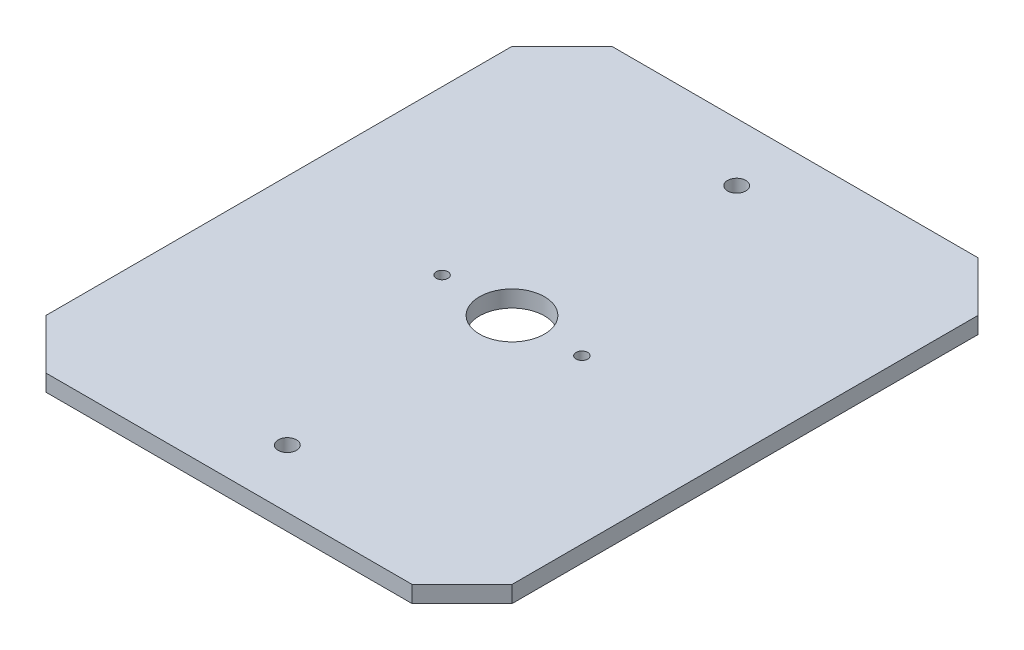
ISO-10303-21;
HEADER;
FILE_DESCRIPTION(('STEP AP214'),'2;1');
FILE_NAME('part.step','',(''),(''),'','','');
FILE_SCHEMA(('AUTOMOTIVE_DESIGN { 1 0 10303 214 1 1 1 1 }'));
ENDSEC;
DATA;
#1=APPLICATION_CONTEXT('core data for automotive mechanical design processes');
#2=APPLICATION_PROTOCOL_DEFINITION('international standard','automotive_design',2000,#1);
#3=PRODUCT_CONTEXT('',#1,'mechanical');
#4=PRODUCT('Part','Part','',(#3));
#5=PRODUCT_RELATED_PRODUCT_CATEGORY('part','',(#4));
#6=PRODUCT_DEFINITION_FORMATION('','',#4);
#7=PRODUCT_DEFINITION_CONTEXT('part definition',#1,'design');
#8=PRODUCT_DEFINITION('design','',#6,#7);
#9=PRODUCT_DEFINITION_SHAPE('','',#8);
#10=(LENGTH_UNIT() NAMED_UNIT(*) SI_UNIT(.MILLI.,.METRE.));
#11=(NAMED_UNIT(*) PLANE_ANGLE_UNIT() SI_UNIT($,.RADIAN.));
#12=(NAMED_UNIT(*) SI_UNIT($,.STERADIAN.) SOLID_ANGLE_UNIT());
#13=UNCERTAINTY_MEASURE_WITH_UNIT(LENGTH_MEASURE(1.E-05),#10,'distance_accuracy_value','');
#14=(GEOMETRIC_REPRESENTATION_CONTEXT(3) GLOBAL_UNCERTAINTY_ASSIGNED_CONTEXT((#13)) GLOBAL_UNIT_ASSIGNED_CONTEXT((#10,
#11,#12)) REPRESENTATION_CONTEXT('',''));
#15=CARTESIAN_POINT('',(0.,0.,0.));
#16=DIRECTION('',(0.,0.,1.));
#17=DIRECTION('',(1.,0.,0.));
#18=AXIS2_PLACEMENT_3D('',#15,#16,#17);
#19=CARTESIAN_POINT('',(-70.,5.,-85.));
#20=DIRECTION('',(1.,0.,0.));
#21=DIRECTION('',(0.,0.,-1.));
#22=AXIS2_PLACEMENT_3D('',#19,#20,#21);
#23=PLANE('',#22);
#24=DIRECTION('',(0.,0.,1.));
#25=VECTOR('',#24,1.);
#26=CARTESIAN_POINT('',(-70.,0.,-85.));
#27=LINE('',#26,#25);
#28=CARTESIAN_POINT('',(-70.,0.,-70.));
#29=VERTEX_POINT('',#28);
#30=CARTESIAN_POINT('',(-70.,0.,70.));
#31=VERTEX_POINT('',#30);
#32=EDGE_CURVE('E181',#29,#31,#27,.T.);
#33=ORIENTED_EDGE('',*,*,#32,.T.);
#34=DIRECTION('',(0.,1.,0.));
#35=VECTOR('',#34,1.);
#36=CARTESIAN_POINT('',(-70.,5.,70.));
#37=LINE('',#36,#35);
#38=CARTESIAN_POINT('',(-70.,5.,70.));
#39=VERTEX_POINT('',#38);
#40=EDGE_CURVE('E11',#31,#39,#37,.T.);
#41=ORIENTED_EDGE('',*,*,#40,.T.);
#42=DIRECTION('',(0.,0.,1.));
#43=VECTOR('',#42,1.);
#44=CARTESIAN_POINT('',(-70.,5.,-85.));
#45=LINE('',#44,#43);
#46=CARTESIAN_POINT('',(-70.,5.,-70.));
#47=VERTEX_POINT('',#46);
#48=EDGE_CURVE('E130',#47,#39,#45,.T.);
#49=ORIENTED_EDGE('',*,*,#48,.F.);
#50=DIRECTION('',(0.,-1.,0.));
#51=VECTOR('',#50,1.);
#52=CARTESIAN_POINT('',(-70.,5.,-70.));
#53=LINE('',#52,#51);
#54=EDGE_CURVE('E45',#47,#29,#53,.T.);
#55=ORIENTED_EDGE('',*,*,#54,.T.);
#56=EDGE_LOOP('',(#33,#41,#49,#55));
#57=FACE_BOUND('',#56,.T.);
#58=ADVANCED_FACE('F35',(#57),#23,.F.);
#59=CARTESIAN_POINT('',(70.,5.,85.));
#60=DIRECTION('',(0.,0.,-1.));
#61=DIRECTION('',(-1.,0.,0.));
#62=AXIS2_PLACEMENT_3D('',#59,#60,#61);
#63=PLANE('',#62);
#64=DIRECTION('',(1.,0.,0.));
#65=VECTOR('',#64,1.);
#66=CARTESIAN_POINT('',(70.,0.,85.));
#67=LINE('',#66,#65);
#68=CARTESIAN_POINT('',(-55.,0.,85.));
#69=VERTEX_POINT('',#68);
#70=CARTESIAN_POINT('',(55.,0.,85.));
#71=VERTEX_POINT('',#70);
#72=EDGE_CURVE('E135',#69,#71,#67,.T.);
#73=ORIENTED_EDGE('',*,*,#72,.T.);
#74=DIRECTION('',(0.,1.,0.));
#75=VECTOR('',#74,1.);
#76=CARTESIAN_POINT('',(55.,5.,85.));
#77=LINE('',#76,#75);
#78=CARTESIAN_POINT('',(55.,5.,85.));
#79=VERTEX_POINT('',#78);
#80=EDGE_CURVE('E53',#71,#79,#77,.T.);
#81=ORIENTED_EDGE('',*,*,#80,.T.);
#82=DIRECTION('',(1.,0.,0.));
#83=VECTOR('',#82,1.);
#84=CARTESIAN_POINT('',(70.,5.,85.));
#85=LINE('',#84,#83);
#86=CARTESIAN_POINT('',(-55.,5.,85.));
#87=VERTEX_POINT('',#86);
#88=EDGE_CURVE('E133',#87,#79,#85,.T.);
#89=ORIENTED_EDGE('',*,*,#88,.F.);
#90=DIRECTION('',(0.,-1.,0.));
#91=VECTOR('',#90,1.);
#92=CARTESIAN_POINT('',(-55.,5.,85.));
#93=LINE('',#92,#91);
#94=EDGE_CURVE('E154',#87,#69,#93,.T.);
#95=ORIENTED_EDGE('',*,*,#94,.T.);
#96=EDGE_LOOP('',(#73,#81,#89,#95));
#97=FACE_BOUND('',#96,.T.);
#98=ADVANCED_FACE('F191',(#97),#63,.F.);
#99=CARTESIAN_POINT('',(70.,5.,-85.));
#100=DIRECTION('',(-1.,0.,0.));
#101=DIRECTION('',(0.,0.,1.));
#102=AXIS2_PLACEMENT_3D('',#99,#100,#101);
#103=PLANE('',#102);
#104=DIRECTION('',(0.,0.,-1.));
#105=VECTOR('',#104,1.);
#106=CARTESIAN_POINT('',(70.,0.,-85.));
#107=LINE('',#106,#105);
#108=CARTESIAN_POINT('',(70.,0.,70.));
#109=VERTEX_POINT('',#108);
#110=CARTESIAN_POINT('',(70.,0.,-70.));
#111=VERTEX_POINT('',#110);
#112=EDGE_CURVE('E131',#109,#111,#107,.T.);
#113=ORIENTED_EDGE('',*,*,#112,.T.);
#114=DIRECTION('',(0.,1.,0.));
#115=VECTOR('',#114,1.);
#116=CARTESIAN_POINT('',(70.,5.,-70.));
#117=LINE('',#116,#115);
#118=CARTESIAN_POINT('',(70.,5.,-70.));
#119=VERTEX_POINT('',#118);
#120=EDGE_CURVE('E109',#111,#119,#117,.T.);
#121=ORIENTED_EDGE('',*,*,#120,.T.);
#122=DIRECTION('',(0.,0.,-1.));
#123=VECTOR('',#122,1.);
#124=CARTESIAN_POINT('',(70.,5.,-85.));
#125=LINE('',#124,#123);
#126=CARTESIAN_POINT('',(70.,5.,70.));
#127=VERTEX_POINT('',#126);
#128=EDGE_CURVE('E185',#127,#119,#125,.T.);
#129=ORIENTED_EDGE('',*,*,#128,.F.);
#130=DIRECTION('',(0.,-1.,0.));
#131=VECTOR('',#130,1.);
#132=CARTESIAN_POINT('',(70.,5.,70.));
#133=LINE('',#132,#131);
#134=EDGE_CURVE('E114',#127,#109,#133,.T.);
#135=ORIENTED_EDGE('',*,*,#134,.T.);
#136=EDGE_LOOP('',(#113,#121,#129,#135));
#137=FACE_BOUND('',#136,.T.);
#138=ADVANCED_FACE('F200',(#137),#103,.F.);
#139=CARTESIAN_POINT('',(70.,5.,-85.));
#140=DIRECTION('',(0.,0.,1.));
#141=DIRECTION('',(1.,0.,0.));
#142=AXIS2_PLACEMENT_3D('',#139,#140,#141);
#143=PLANE('',#142);
#144=DIRECTION('',(-1.,0.,0.));
#145=VECTOR('',#144,1.);
#146=CARTESIAN_POINT('',(70.,5.,-85.));
#147=LINE('',#146,#145);
#148=CARTESIAN_POINT('',(55.,5.,-85.));
#149=VERTEX_POINT('',#148);
#150=CARTESIAN_POINT('',(-55.,5.,-85.));
#151=VERTEX_POINT('',#150);
#152=EDGE_CURVE('E124',#149,#151,#147,.T.);
#153=ORIENTED_EDGE('',*,*,#152,.F.);
#154=DIRECTION('',(0.,-1.,0.));
#155=VECTOR('',#154,1.);
#156=CARTESIAN_POINT('',(55.,5.,-85.));
#157=LINE('',#156,#155);
#158=CARTESIAN_POINT('',(55.,0.,-85.));
#159=VERTEX_POINT('',#158);
#160=EDGE_CURVE('E108',#149,#159,#157,.T.);
#161=ORIENTED_EDGE('',*,*,#160,.T.);
#162=DIRECTION('',(-1.,0.,0.));
#163=VECTOR('',#162,1.);
#164=CARTESIAN_POINT('',(70.,0.,-85.));
#165=LINE('',#164,#163);
#166=CARTESIAN_POINT('',(-55.,0.,-85.));
#167=VERTEX_POINT('',#166);
#168=EDGE_CURVE('E121',#159,#167,#165,.T.);
#169=ORIENTED_EDGE('',*,*,#168,.T.);
#170=DIRECTION('',(0.,1.,0.));
#171=VECTOR('',#170,1.);
#172=CARTESIAN_POINT('',(-55.,5.,-85.));
#173=LINE('',#172,#171);
#174=EDGE_CURVE('E126',#167,#151,#173,.T.);
#175=ORIENTED_EDGE('',*,*,#174,.T.);
#176=EDGE_LOOP('',(#153,#161,#169,#175));
#177=FACE_BOUND('',#176,.T.);
#178=ADVANCED_FACE('F120',(#177),#143,.F.);
#179=CARTESIAN_POINT('',(0.,5.,0.));
#180=DIRECTION('',(0.,-1.,0.));
#181=DIRECTION('',(0.,0.,-1.));
#182=AXIS2_PLACEMENT_3D('',#179,#180,#181);
#183=PLANE('',#182);
#184=CARTESIAN_POINT('',(-21.,5.,0.));
#185=DIRECTION('',(0.,1.,0.));
#186=DIRECTION('',(0.,0.,1.));
#187=AXIS2_PLACEMENT_3D('',#184,#185,#186);
#188=CIRCLE('',#187,1.75);
#189=CARTESIAN_POINT('',(-21.,5.,1.75));
#190=VERTEX_POINT('',#189);
#191=EDGE_CURVE('E288',#190,#190,#188,.T.);
#192=ORIENTED_EDGE('',*,*,#191,.F.);
#193=EDGE_LOOP('',(#192));
#194=FACE_BOUND('',#193,.T.);
#195=CARTESIAN_POINT('',(21.,5.,0.));
#196=DIRECTION('',(0.,1.,0.));
#197=DIRECTION('',(0.,0.,-1.));
#198=AXIS2_PLACEMENT_3D('',#195,#196,#197);
#199=CIRCLE('',#198,1.75);
#200=CARTESIAN_POINT('',(21.,5.,-1.75));
#201=VERTEX_POINT('',#200);
#202=EDGE_CURVE('E175',#201,#201,#199,.T.);
#203=ORIENTED_EDGE('',*,*,#202,.F.);
#204=EDGE_LOOP('',(#203));
#205=FACE_BOUND('',#204,.T.);
#206=CARTESIAN_POINT('',(0.,5.,67.5));
#207=DIRECTION('',(0.,1.,0.));
#208=DIRECTION('',(0.,0.,1.));
#209=AXIS2_PLACEMENT_3D('',#206,#207,#208);
#210=CIRCLE('',#209,2.75);
#211=CARTESIAN_POINT('',(0.,5.,70.25));
#212=VERTEX_POINT('',#211);
#213=EDGE_CURVE('E161',#212,#212,#210,.T.);
#214=ORIENTED_EDGE('',*,*,#213,.F.);
#215=EDGE_LOOP('',(#214));
#216=FACE_BOUND('',#215,.T.);
#217=CARTESIAN_POINT('',(0.,5.,-67.5));
#218=DIRECTION('',(0.,1.,0.));
#219=DIRECTION('',(0.,0.,-1.));
#220=AXIS2_PLACEMENT_3D('',#217,#218,#219);
#221=CIRCLE('',#220,2.75);
#222=CARTESIAN_POINT('',(0.,5.,-70.25));
#223=VERTEX_POINT('',#222);
#224=EDGE_CURVE('E167',#223,#223,#221,.T.);
#225=ORIENTED_EDGE('',*,*,#224,.F.);
#226=EDGE_LOOP('',(#225));
#227=FACE_BOUND('',#226,.T.);
#228=CARTESIAN_POINT('',(0.,5.,0.));
#229=DIRECTION('',(0.,1.,0.));
#230=DIRECTION('',(0.,0.,1.));
#231=AXIS2_PLACEMENT_3D('',#228,#229,#230);
#232=CIRCLE('',#231,9.75);
#233=CARTESIAN_POINT('',(0.,5.,9.75));
#234=VERTEX_POINT('',#233);
#235=EDGE_CURVE('E165',#234,#234,#232,.T.);
#236=ORIENTED_EDGE('',*,*,#235,.F.);
#237=EDGE_LOOP('',(#236));
#238=FACE_BOUND('',#237,.T.);
#239=ORIENTED_EDGE('',*,*,#128,.T.);
#240=DIRECTION('',(0.707106781186546,0.,0.707106781186549));
#241=VECTOR('',#240,1.);
#242=CARTESIAN_POINT('',(55.,5.,-85.));
#243=LINE('',#242,#241);
#244=EDGE_CURVE('E152',#119,#149,#243,.F.);
#245=ORIENTED_EDGE('',*,*,#244,.T.);
#246=ORIENTED_EDGE('',*,*,#152,.T.);
#247=DIRECTION('',(0.707106781186549,0.,-0.707106781186546));
#248=VECTOR('',#247,1.);
#249=CARTESIAN_POINT('',(-70.,5.,-70.));
#250=LINE('',#249,#248);
#251=EDGE_CURVE('E147',#151,#47,#250,.F.);
#252=ORIENTED_EDGE('',*,*,#251,.T.);
#253=ORIENTED_EDGE('',*,*,#48,.T.);
#254=DIRECTION('',(-0.707106781186547,0.,-0.707106781186548));
#255=VECTOR('',#254,1.);
#256=CARTESIAN_POINT('',(-55.,5.,85.));
#257=LINE('',#256,#255);
#258=EDGE_CURVE('E60',#39,#87,#257,.F.);
#259=ORIENTED_EDGE('',*,*,#258,.T.);
#260=ORIENTED_EDGE('',*,*,#88,.T.);
#261=DIRECTION('',(-0.707106781186549,0.,0.707106781186546));
#262=VECTOR('',#261,1.);
#263=CARTESIAN_POINT('',(70.,5.,70.));
#264=LINE('',#263,#262);
#265=EDGE_CURVE('E150',#79,#127,#264,.F.);
#266=ORIENTED_EDGE('',*,*,#265,.T.);
#267=EDGE_LOOP('',(#239,#245,#246,#252,#253,#259,#260,#266));
#268=FACE_BOUND('',#267,.T.);
#269=ADVANCED_FACE('F198',(#194,#205,#216,#227,#238,#268),#183,.F.);
#270=CARTESIAN_POINT('',(0.,0.,0.));
#271=DIRECTION('',(0.,-1.,0.));
#272=DIRECTION('',(0.,0.,-1.));
#273=AXIS2_PLACEMENT_3D('',#270,#271,#272);
#274=PLANE('',#273);
#275=CARTESIAN_POINT('',(-21.,0.,0.));
#276=DIRECTION('',(0.,1.,0.));
#277=DIRECTION('',(0.,0.,1.));
#278=AXIS2_PLACEMENT_3D('',#275,#276,#277);
#279=CIRCLE('',#278,1.75);
#280=CARTESIAN_POINT('',(-21.,0.,1.75));
#281=VERTEX_POINT('',#280);
#282=EDGE_CURVE('E172',#281,#281,#279,.T.);
#283=ORIENTED_EDGE('',*,*,#282,.T.);
#284=EDGE_LOOP('',(#283));
#285=FACE_BOUND('',#284,.T.);
#286=CARTESIAN_POINT('',(21.,0.,0.));
#287=DIRECTION('',(0.,1.,0.));
#288=DIRECTION('',(0.,0.,-1.));
#289=AXIS2_PLACEMENT_3D('',#286,#287,#288);
#290=CIRCLE('',#289,1.75);
#291=CARTESIAN_POINT('',(21.,0.,-1.75));
#292=VERTEX_POINT('',#291);
#293=EDGE_CURVE('E267',#292,#292,#290,.T.);
#294=ORIENTED_EDGE('',*,*,#293,.T.);
#295=EDGE_LOOP('',(#294));
#296=FACE_BOUND('',#295,.T.);
#297=CARTESIAN_POINT('',(0.,0.,67.5));
#298=DIRECTION('',(0.,-1.,0.));
#299=DIRECTION('',(0.,0.,-1.));
#300=AXIS2_PLACEMENT_3D('',#297,#298,#299);
#301=CIRCLE('',#300,2.75);
#302=CARTESIAN_POINT('',(0.,0.,64.75));
#303=VERTEX_POINT('',#302);
#304=EDGE_CURVE('E40',#303,#303,#301,.T.);
#305=ORIENTED_EDGE('',*,*,#304,.F.);
#306=EDGE_LOOP('',(#305));
#307=FACE_BOUND('',#306,.T.);
#308=CARTESIAN_POINT('',(0.,0.,-67.5));
#309=DIRECTION('',(0.,-1.,0.));
#310=DIRECTION('',(0.,0.,-1.));
#311=AXIS2_PLACEMENT_3D('',#308,#309,#310);
#312=CIRCLE('',#311,2.75);
#313=CARTESIAN_POINT('',(0.,0.,-70.25));
#314=VERTEX_POINT('',#313);
#315=EDGE_CURVE('E159',#314,#314,#312,.T.);
#316=ORIENTED_EDGE('',*,*,#315,.F.);
#317=EDGE_LOOP('',(#316));
#318=FACE_BOUND('',#317,.T.);
#319=CARTESIAN_POINT('',(0.,0.,0.));
#320=DIRECTION('',(0.,1.,0.));
#321=DIRECTION('',(0.,0.,1.));
#322=AXIS2_PLACEMENT_3D('',#319,#320,#321);
#323=CIRCLE('',#322,9.75);
#324=CARTESIAN_POINT('',(0.,0.,9.75));
#325=VERTEX_POINT('',#324);
#326=EDGE_CURVE('E178',#325,#325,#323,.T.);
#327=ORIENTED_EDGE('',*,*,#326,.T.);
#328=EDGE_LOOP('',(#327));
#329=FACE_BOUND('',#328,.T.);
#330=ORIENTED_EDGE('',*,*,#168,.F.);
#331=DIRECTION('',(-0.707106781186546,0.,-0.707106781186549));
#332=VECTOR('',#331,1.);
#333=CARTESIAN_POINT('',(70.0000000000001,0.,-69.9999999999998));
#334=LINE('',#333,#332);
#335=EDGE_CURVE('E104',#159,#111,#334,.F.);
#336=ORIENTED_EDGE('',*,*,#335,.T.);
#337=ORIENTED_EDGE('',*,*,#112,.F.);
#338=DIRECTION('',(0.707106781186549,0.,-0.707106781186546));
#339=VECTOR('',#338,1.);
#340=CARTESIAN_POINT('',(69.9999999999999,0.,70.0000000000001));
#341=LINE('',#340,#339);
#342=EDGE_CURVE('E115',#109,#71,#341,.F.);
#343=ORIENTED_EDGE('',*,*,#342,.T.);
#344=ORIENTED_EDGE('',*,*,#72,.F.);
#345=DIRECTION('',(0.707106781186547,0.,0.707106781186548));
#346=VECTOR('',#345,1.);
#347=CARTESIAN_POINT('',(-70.0000000000001,0.,69.9999999999999));
#348=LINE('',#347,#346);
#349=EDGE_CURVE('E141',#69,#31,#348,.F.);
#350=ORIENTED_EDGE('',*,*,#349,.T.);
#351=ORIENTED_EDGE('',*,*,#32,.F.);
#352=DIRECTION('',(-0.707106781186549,0.,0.707106781186546));
#353=VECTOR('',#352,1.);
#354=CARTESIAN_POINT('',(-69.9999999999999,0.,-70.0000000000001));
#355=LINE('',#354,#353);
#356=EDGE_CURVE('E125',#29,#167,#355,.F.);
#357=ORIENTED_EDGE('',*,*,#356,.T.);
#358=EDGE_LOOP('',(#330,#336,#337,#343,#344,#350,#351,#357));
#359=FACE_BOUND('',#358,.T.);
#360=ADVANCED_FACE('F128',(#285,#296,#307,#318,#329,#359),#274,.T.);
#361=CARTESIAN_POINT('',(55.,5.,-85.));
#362=DIRECTION('',(-0.707106781186549,0.,0.707106781186546));
#363=DIRECTION('',(0.,-1.,0.));
#364=AXIS2_PLACEMENT_3D('',#361,#362,#363);
#365=PLANE('',#364);
#366=ORIENTED_EDGE('',*,*,#244,.F.);
#367=ORIENTED_EDGE('',*,*,#120,.F.);
#368=ORIENTED_EDGE('',*,*,#335,.F.);
#369=ORIENTED_EDGE('',*,*,#160,.F.);
#370=EDGE_LOOP('',(#366,#367,#368,#369));
#371=FACE_BOUND('',#370,.T.);
#372=ADVANCED_FACE('F107',(#371),#365,.F.);
#373=CARTESIAN_POINT('',(70.,5.,70.));
#374=DIRECTION('',(-0.707106781186546,0.,-0.707106781186549));
#375=DIRECTION('',(0.,-1.,0.));
#376=AXIS2_PLACEMENT_3D('',#373,#374,#375);
#377=PLANE('',#376);
#378=ORIENTED_EDGE('',*,*,#265,.F.);
#379=ORIENTED_EDGE('',*,*,#80,.F.);
#380=ORIENTED_EDGE('',*,*,#342,.F.);
#381=ORIENTED_EDGE('',*,*,#134,.F.);
#382=EDGE_LOOP('',(#378,#379,#380,#381));
#383=FACE_BOUND('',#382,.T.);
#384=ADVANCED_FACE('F195',(#383),#377,.F.);
#385=CARTESIAN_POINT('',(-55.,5.,85.));
#386=DIRECTION('',(0.707106781186548,0.,-0.707106781186547));
#387=DIRECTION('',(0.,-1.,0.));
#388=AXIS2_PLACEMENT_3D('',#385,#386,#387);
#389=PLANE('',#388);
#390=ORIENTED_EDGE('',*,*,#258,.F.);
#391=ORIENTED_EDGE('',*,*,#40,.F.);
#392=ORIENTED_EDGE('',*,*,#349,.F.);
#393=ORIENTED_EDGE('',*,*,#94,.F.);
#394=EDGE_LOOP('',(#390,#391,#392,#393));
#395=FACE_BOUND('',#394,.T.);
#396=ADVANCED_FACE('F225',(#395),#389,.F.);
#397=CARTESIAN_POINT('',(-70.,5.,-70.));
#398=DIRECTION('',(0.707106781186546,0.,0.707106781186549));
#399=DIRECTION('',(0.,-1.,0.));
#400=AXIS2_PLACEMENT_3D('',#397,#398,#399);
#401=PLANE('',#400);
#402=ORIENTED_EDGE('',*,*,#251,.F.);
#403=ORIENTED_EDGE('',*,*,#174,.F.);
#404=ORIENTED_EDGE('',*,*,#356,.F.);
#405=ORIENTED_EDGE('',*,*,#54,.F.);
#406=EDGE_LOOP('',(#402,#403,#404,#405));
#407=FACE_BOUND('',#406,.T.);
#408=ADVANCED_FACE('F38',(#407),#401,.F.);
#409=CARTESIAN_POINT('',(0.,0.,0.));
#410=DIRECTION('',(0.,1.,0.));
#411=DIRECTION('',(0.,0.,1.));
#412=AXIS2_PLACEMENT_3D('',#409,#410,#411);
#413=CYLINDRICAL_SURFACE('',#412,9.75);
#414=ORIENTED_EDGE('',*,*,#326,.F.);
#415=EDGE_LOOP('',(#414));
#416=FACE_BOUND('',#415,.T.);
#417=ORIENTED_EDGE('',*,*,#235,.T.);
#418=EDGE_LOOP('',(#417));
#419=FACE_BOUND('',#418,.T.);
#420=ADVANCED_FACE('F233',(#416,#419),#413,.F.);
#421=CARTESIAN_POINT('',(0.,-35.,-67.5));
#422=DIRECTION('',(0.,1.,0.));
#423=DIRECTION('',(0.,0.,1.));
#424=AXIS2_PLACEMENT_3D('',#421,#422,#423);
#425=CYLINDRICAL_SURFACE('',#424,2.75);
#426=ORIENTED_EDGE('',*,*,#315,.T.);
#427=EDGE_LOOP('',(#426));
#428=FACE_BOUND('',#427,.T.);
#429=ORIENTED_EDGE('',*,*,#224,.T.);
#430=EDGE_LOOP('',(#429));
#431=FACE_BOUND('',#430,.T.);
#432=ADVANCED_FACE('F242',(#428,#431),#425,.F.);
#433=CARTESIAN_POINT('',(0.,-35.,67.5));
#434=DIRECTION('',(0.,1.,0.));
#435=DIRECTION('',(0.,0.,1.));
#436=AXIS2_PLACEMENT_3D('',#433,#434,#435);
#437=CYLINDRICAL_SURFACE('',#436,2.75);
#438=ORIENTED_EDGE('',*,*,#304,.T.);
#439=EDGE_LOOP('',(#438));
#440=FACE_BOUND('',#439,.T.);
#441=ORIENTED_EDGE('',*,*,#213,.T.);
#442=EDGE_LOOP('',(#441));
#443=FACE_BOUND('',#442,.T.);
#444=ADVANCED_FACE('F248',(#440,#443),#437,.F.);
#445=CARTESIAN_POINT('',(21.,0.,0.));
#446=DIRECTION('',(0.,1.,0.));
#447=DIRECTION('',(0.,0.,1.));
#448=AXIS2_PLACEMENT_3D('',#445,#446,#447);
#449=CYLINDRICAL_SURFACE('',#448,1.75);
#450=ORIENTED_EDGE('',*,*,#293,.F.);
#451=EDGE_LOOP('',(#450));
#452=FACE_BOUND('',#451,.T.);
#453=ORIENTED_EDGE('',*,*,#202,.T.);
#454=EDGE_LOOP('',(#453));
#455=FACE_BOUND('',#454,.T.);
#456=ADVANCED_FACE('F273',(#452,#455),#449,.F.);
#457=CARTESIAN_POINT('',(-21.,0.,0.));
#458=DIRECTION('',(0.,1.,0.));
#459=DIRECTION('',(0.,0.,1.));
#460=AXIS2_PLACEMENT_3D('',#457,#458,#459);
#461=CYLINDRICAL_SURFACE('',#460,1.75);
#462=ORIENTED_EDGE('',*,*,#282,.F.);
#463=EDGE_LOOP('',(#462));
#464=FACE_BOUND('',#463,.T.);
#465=ORIENTED_EDGE('',*,*,#191,.T.);
#466=EDGE_LOOP('',(#465));
#467=FACE_BOUND('',#466,.T.);
#468=ADVANCED_FACE('F277',(#464,#467),#461,.F.);
#469=CLOSED_SHELL('',(#58,#98,#138,#178,#269,#360,#372,#384,#396,#408,#420,#432,#444,#456,#468));
#470=MANIFOLD_SOLID_BREP('B2',#469);
#471=ADVANCED_BREP_SHAPE_REPRESENTATION('',(#18,#470),#14);
#472=SHAPE_DEFINITION_REPRESENTATION(#9,#471);
ENDSEC;
END-ISO-10303-21;
